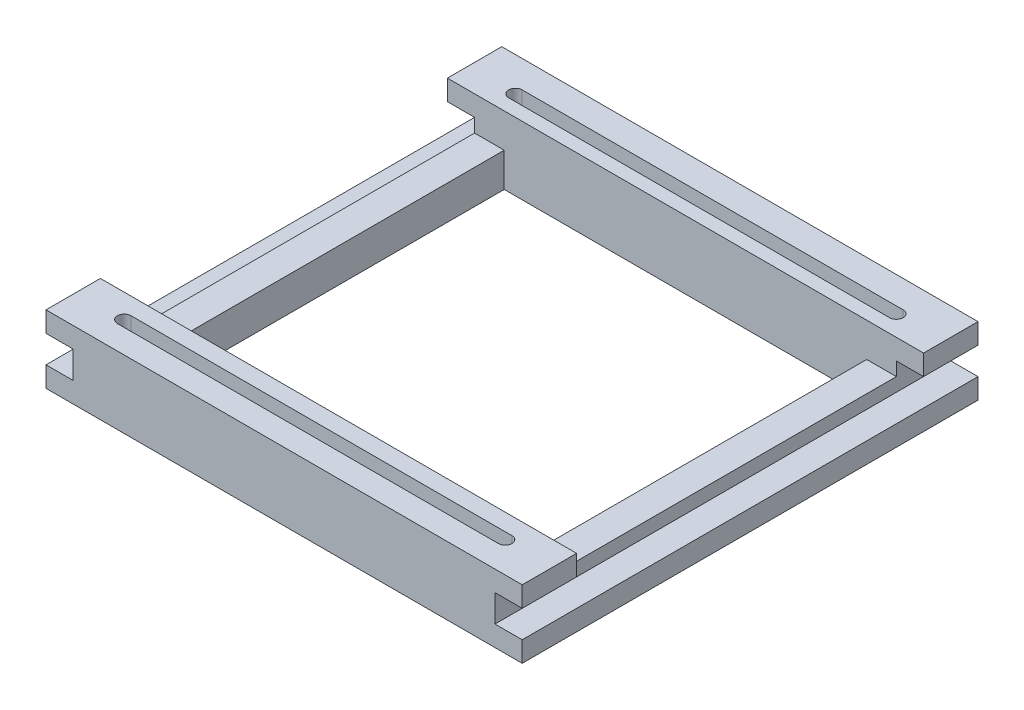
ISO-10303-21;
HEADER;
FILE_DESCRIPTION(('STEP AP214'),'2;1');
FILE_NAME('part.step','',(''),(''),'','','');
FILE_SCHEMA(('AUTOMOTIVE_DESIGN { 1 0 10303 214 1 1 1 1 }'));
ENDSEC;
DATA;
#1=APPLICATION_CONTEXT('core data for automotive mechanical design processes');
#2=APPLICATION_PROTOCOL_DEFINITION('international standard','automotive_design',2000,#1);
#3=PRODUCT_CONTEXT('',#1,'mechanical');
#4=PRODUCT('Part','Part','',(#3));
#5=PRODUCT_RELATED_PRODUCT_CATEGORY('part','',(#4));
#6=PRODUCT_DEFINITION_FORMATION('','',#4);
#7=PRODUCT_DEFINITION_CONTEXT('part definition',#1,'design');
#8=PRODUCT_DEFINITION('design','',#6,#7);
#9=PRODUCT_DEFINITION_SHAPE('','',#8);
#10=(LENGTH_UNIT() NAMED_UNIT(*) SI_UNIT(.MILLI.,.METRE.));
#11=(NAMED_UNIT(*) PLANE_ANGLE_UNIT() SI_UNIT($,.RADIAN.));
#12=(NAMED_UNIT(*) SI_UNIT($,.STERADIAN.) SOLID_ANGLE_UNIT());
#13=UNCERTAINTY_MEASURE_WITH_UNIT(LENGTH_MEASURE(1.E-05),#10,'distance_accuracy_value','');
#14=(GEOMETRIC_REPRESENTATION_CONTEXT(3) GLOBAL_UNCERTAINTY_ASSIGNED_CONTEXT((#13)) GLOBAL_UNIT_ASSIGNED_CONTEXT((#10,
#11,#12)) REPRESENTATION_CONTEXT('',''));
#15=CARTESIAN_POINT('',(0.,0.,0.));
#16=DIRECTION('',(0.,0.,1.));
#17=DIRECTION('',(1.,0.,0.));
#18=AXIS2_PLACEMENT_3D('',#15,#16,#17);
#19=CARTESIAN_POINT('',(35.,10.,33.5));
#20=DIRECTION('',(-1.,0.,0.));
#21=DIRECTION('',(0.,0.,1.));
#22=AXIS2_PLACEMENT_3D('',#19,#20,#21);
#23=PLANE('',#22);
#24=DIRECTION('',(0.,-1.,0.));
#25=VECTOR('',#24,1.);
#26=CARTESIAN_POINT('',(35.,10.,-33.5));
#27=LINE('',#26,#25);
#28=CARTESIAN_POINT('',(35.,3.,-33.5));
#29=VERTEX_POINT('',#28);
#30=CARTESIAN_POINT('',(35.,0.,-33.5));
#31=VERTEX_POINT('',#30);
#32=EDGE_CURVE('E467',#29,#31,#27,.T.);
#33=ORIENTED_EDGE('',*,*,#32,.F.);
#34=DIRECTION('',(0.,0.,1.));
#35=VECTOR('',#34,1.);
#36=CARTESIAN_POINT('',(35.,3.,-33.5));
#37=LINE('',#36,#35);
#38=CARTESIAN_POINT('',(35.,3.,33.5));
#39=VERTEX_POINT('',#38);
#40=EDGE_CURVE('E332',#29,#39,#37,.T.);
#41=ORIENTED_EDGE('',*,*,#40,.T.);
#42=DIRECTION('',(0.,-1.,0.));
#43=VECTOR('',#42,1.);
#44=CARTESIAN_POINT('',(35.,10.,33.5));
#45=LINE('',#44,#43);
#46=CARTESIAN_POINT('',(35.,0.,33.5));
#47=VERTEX_POINT('',#46);
#48=EDGE_CURVE('E444',#39,#47,#45,.T.);
#49=ORIENTED_EDGE('',*,*,#48,.T.);
#50=DIRECTION('',(0.,0.,-1.));
#51=VECTOR('',#50,1.);
#52=CARTESIAN_POINT('',(35.,0.,33.5));
#53=LINE('',#52,#51);
#54=EDGE_CURVE('E431',#47,#31,#53,.T.);
#55=ORIENTED_EDGE('',*,*,#54,.T.);
#56=EDGE_LOOP('',(#33,#41,#49,#55));
#57=FACE_BOUND('',#56,.T.);
#58=ADVANCED_FACE('F38',(#57),#23,.F.);
#59=CARTESIAN_POINT('',(35.,10.,33.5));
#60=VERTEX_POINT('',#59);
#61=CARTESIAN_POINT('',(35.,7.,33.5));
#62=VERTEX_POINT('',#61);
#63=EDGE_CURVE('E456',#60,#62,#45,.T.);
#64=ORIENTED_EDGE('',*,*,#63,.T.);
#65=DIRECTION('',(0.,0.,1.));
#66=VECTOR('',#65,1.);
#67=CARTESIAN_POINT('',(35.,7.,-33.5));
#68=LINE('',#67,#66);
#69=CARTESIAN_POINT('',(35.,7.,25.5));
#70=VERTEX_POINT('',#69);
#71=EDGE_CURVE('E323',#70,#62,#68,.T.);
#72=ORIENTED_EDGE('',*,*,#71,.F.);
#73=DIRECTION('',(0.,1.,0.));
#74=VECTOR('',#73,1.);
#75=CARTESIAN_POINT('',(35.,5.,25.5));
#76=LINE('',#75,#74);
#77=CARTESIAN_POINT('',(35.,10.,25.5));
#78=VERTEX_POINT('',#77);
#79=EDGE_CURVE('E403',#70,#78,#76,.T.);
#80=ORIENTED_EDGE('',*,*,#79,.T.);
#81=DIRECTION('',(0.,0.,-1.));
#82=VECTOR('',#81,1.);
#83=CARTESIAN_POINT('',(35.,10.,33.5));
#84=LINE('',#83,#82);
#85=EDGE_CURVE('E432',#60,#78,#84,.T.);
#86=ORIENTED_EDGE('',*,*,#85,.F.);
#87=EDGE_LOOP('',(#64,#72,#80,#86));
#88=FACE_BOUND('',#87,.T.);
#89=ADVANCED_FACE('F535',(#88),#23,.F.);
#90=CARTESIAN_POINT('',(-35.,10.,33.5));
#91=DIRECTION('',(1.,0.,0.));
#92=DIRECTION('',(0.,0.,-1.));
#93=AXIS2_PLACEMENT_3D('',#90,#91,#92);
#94=PLANE('',#93);
#95=DIRECTION('',(0.,-1.,0.));
#96=VECTOR('',#95,1.);
#97=CARTESIAN_POINT('',(-35.,10.,-33.5));
#98=LINE('',#97,#96);
#99=CARTESIAN_POINT('',(-35.,10.,-33.5));
#100=VERTEX_POINT('',#99);
#101=CARTESIAN_POINT('',(-35.,7.,-33.5));
#102=VERTEX_POINT('',#101);
#103=EDGE_CURVE('E464',#100,#102,#98,.T.);
#104=ORIENTED_EDGE('',*,*,#103,.T.);
#105=DIRECTION('',(0.,0.,1.));
#106=VECTOR('',#105,1.);
#107=CARTESIAN_POINT('',(-35.,7.,-33.5));
#108=LINE('',#107,#106);
#109=CARTESIAN_POINT('',(-35.,7.,-25.5));
#110=VERTEX_POINT('',#109);
#111=EDGE_CURVE('E328',#102,#110,#108,.T.);
#112=ORIENTED_EDGE('',*,*,#111,.T.);
#113=DIRECTION('',(0.,1.,0.));
#114=VECTOR('',#113,1.);
#115=CARTESIAN_POINT('',(-35.,5.,-25.5));
#116=LINE('',#115,#114);
#117=CARTESIAN_POINT('',(-35.,10.,-25.5));
#118=VERTEX_POINT('',#117);
#119=EDGE_CURVE('E392',#110,#118,#116,.T.);
#120=ORIENTED_EDGE('',*,*,#119,.T.);
#121=DIRECTION('',(0.,0.,1.));
#122=VECTOR('',#121,1.);
#123=CARTESIAN_POINT('',(-35.,10.,33.5));
#124=LINE('',#123,#122);
#125=EDGE_CURVE('E439',#100,#118,#124,.T.);
#126=ORIENTED_EDGE('',*,*,#125,.F.);
#127=EDGE_LOOP('',(#104,#112,#120,#126));
#128=FACE_BOUND('',#127,.T.);
#129=ADVANCED_FACE('F577',(#128),#94,.F.);
#130=DIRECTION('',(0.,1.,0.));
#131=VECTOR('',#130,1.);
#132=CARTESIAN_POINT('',(-35.,5.,25.5));
#133=LINE('',#132,#131);
#134=CARTESIAN_POINT('',(-35.,7.,25.5));
#135=VERTEX_POINT('',#134);
#136=CARTESIAN_POINT('',(-35.,10.,25.5));
#137=VERTEX_POINT('',#136);
#138=EDGE_CURVE('E393',#135,#137,#133,.T.);
#139=ORIENTED_EDGE('',*,*,#138,.F.);
#140=CARTESIAN_POINT('',(-35.,7.,33.5));
#141=VERTEX_POINT('',#140);
#142=EDGE_CURVE('E363',#135,#141,#108,.T.);
#143=ORIENTED_EDGE('',*,*,#142,.T.);
#144=DIRECTION('',(0.,-1.,0.));
#145=VECTOR('',#144,1.);
#146=CARTESIAN_POINT('',(-35.,10.,33.5));
#147=LINE('',#146,#145);
#148=CARTESIAN_POINT('',(-35.,10.,33.5));
#149=VERTEX_POINT('',#148);
#150=EDGE_CURVE('E460',#149,#141,#147,.T.);
#151=ORIENTED_EDGE('',*,*,#150,.F.);
#152=EDGE_CURVE('E438',#137,#149,#124,.T.);
#153=ORIENTED_EDGE('',*,*,#152,.F.);
#154=EDGE_LOOP('',(#139,#143,#151,#153));
#155=FACE_BOUND('',#154,.T.);
#156=ADVANCED_FACE('F526',(#155),#94,.F.);
#157=CARTESIAN_POINT('',(0.,10.,0.));
#158=DIRECTION('',(0.,-1.,0.));
#159=DIRECTION('',(0.,0.,-1.));
#160=AXIS2_PLACEMENT_3D('',#157,#158,#159);
#161=PLANE('',#160);
#162=DIRECTION('',(1.,0.,0.));
#163=VECTOR('',#162,1.);
#164=CARTESIAN_POINT('',(-28.,10.,28.));
#165=LINE('',#164,#163);
#166=CARTESIAN_POINT('',(-28.,10.,28.));
#167=VERTEX_POINT('',#166);
#168=CARTESIAN_POINT('',(28.,10.,28.));
#169=VERTEX_POINT('',#168);
#170=EDGE_CURVE('E301',#167,#169,#165,.T.);
#171=ORIENTED_EDGE('',*,*,#170,.T.);
#172=CARTESIAN_POINT('',(28.,10.,29.));
#173=DIRECTION('',(0.,1.,0.));
#174=DIRECTION('',(0.,0.,1.));
#175=AXIS2_PLACEMENT_3D('',#172,#173,#174);
#176=CIRCLE('',#175,0.999999999999997);
#177=CARTESIAN_POINT('',(28.,10.,30.));
#178=VERTEX_POINT('',#177);
#179=EDGE_CURVE('E53',#178,#169,#176,.T.);
#180=ORIENTED_EDGE('',*,*,#179,.F.);
#181=DIRECTION('',(-1.,0.,0.));
#182=VECTOR('',#181,1.);
#183=CARTESIAN_POINT('',(28.,10.,30.));
#184=LINE('',#183,#182);
#185=CARTESIAN_POINT('',(-28.,10.,30.));
#186=VERTEX_POINT('',#185);
#187=EDGE_CURVE('E294',#178,#186,#184,.T.);
#188=ORIENTED_EDGE('',*,*,#187,.T.);
#189=CARTESIAN_POINT('',(-28.,10.,29.));
#190=DIRECTION('',(0.,1.,0.));
#191=DIRECTION('',(0.,0.,1.));
#192=AXIS2_PLACEMENT_3D('',#189,#190,#191);
#193=CIRCLE('',#192,0.999999999999997);
#194=EDGE_CURVE('E297',#167,#186,#193,.T.);
#195=ORIENTED_EDGE('',*,*,#194,.F.);
#196=EDGE_LOOP('',(#171,#180,#188,#195));
#197=FACE_BOUND('',#196,.T.);
#198=DIRECTION('',(1.,0.,0.));
#199=VECTOR('',#198,1.);
#200=CARTESIAN_POINT('',(-26.6417910447761,10.,25.5));
#201=LINE('',#200,#199);
#202=EDGE_CURVE('E409',#137,#78,#201,.T.);
#203=ORIENTED_EDGE('',*,*,#202,.F.);
#204=ORIENTED_EDGE('',*,*,#152,.T.);
#205=DIRECTION('',(1.,0.,0.));
#206=VECTOR('',#205,1.);
#207=CARTESIAN_POINT('',(-35.,10.,33.5));
#208=LINE('',#207,#206);
#209=EDGE_CURVE('E442',#149,#60,#208,.T.);
#210=ORIENTED_EDGE('',*,*,#209,.T.);
#211=ORIENTED_EDGE('',*,*,#85,.T.);
#212=EDGE_LOOP('',(#203,#204,#210,#211));
#213=FACE_BOUND('',#212,.T.);
#214=ADVANCED_FACE('F531',(#197,#213),#161,.F.);
#215=CARTESIAN_POINT('',(26.6417910447761,10.,25.5));
#216=DIRECTION('',(-1.,0.,0.));
#217=DIRECTION('',(0.,0.,1.));
#218=AXIS2_PLACEMENT_3D('',#215,#216,#217);
#219=PLANE('',#218);
#220=DIRECTION('',(0.,-1.,0.));
#221=VECTOR('',#220,1.);
#222=CARTESIAN_POINT('',(26.6417910447761,10.,25.5));
#223=LINE('',#222,#221);
#224=CARTESIAN_POINT('',(26.6417910447761,5.,25.5));
#225=VERTEX_POINT('',#224);
#226=CARTESIAN_POINT('',(26.6417910447761,0.,25.5));
#227=VERTEX_POINT('',#226);
#228=EDGE_CURVE('E413',#225,#227,#223,.T.);
#229=ORIENTED_EDGE('',*,*,#228,.F.);
#230=DIRECTION('',(0.,0.,1.));
#231=VECTOR('',#230,1.);
#232=CARTESIAN_POINT('',(26.6417910447761,5.,-25.5));
#233=LINE('',#232,#231);
#234=CARTESIAN_POINT('',(26.6417910447761,5.,-25.5));
#235=VERTEX_POINT('',#234);
#236=EDGE_CURVE('E382',#235,#225,#233,.T.);
#237=ORIENTED_EDGE('',*,*,#236,.F.);
#238=DIRECTION('',(0.,-1.,0.));
#239=VECTOR('',#238,1.);
#240=CARTESIAN_POINT('',(26.6417910447761,10.,-25.5));
#241=LINE('',#240,#239);
#242=CARTESIAN_POINT('',(26.6417910447761,0.,-25.5));
#243=VERTEX_POINT('',#242);
#244=EDGE_CURVE('E429',#235,#243,#241,.T.);
#245=ORIENTED_EDGE('',*,*,#244,.T.);
#246=DIRECTION('',(0.,0.,-1.));
#247=VECTOR('',#246,1.);
#248=CARTESIAN_POINT('',(26.6417910447761,0.,25.5));
#249=LINE('',#248,#247);
#250=EDGE_CURVE('E395',#227,#243,#249,.T.);
#251=ORIENTED_EDGE('',*,*,#250,.F.);
#252=EDGE_LOOP('',(#229,#237,#245,#251));
#253=FACE_BOUND('',#252,.T.);
#254=ADVANCED_FACE('F556',(#253),#219,.T.);
#255=DIRECTION('',(-1.,0.,0.));
#256=VECTOR('',#255,1.);
#257=CARTESIAN_POINT('',(28.,10.,-27.5));
#258=LINE('',#257,#256);
#259=CARTESIAN_POINT('',(28.,10.,-27.5));
#260=VERTEX_POINT('',#259);
#261=CARTESIAN_POINT('',(-28.,10.,-27.5));
#262=VERTEX_POINT('',#261);
#263=EDGE_CURVE('E275',#260,#262,#258,.T.);
#264=ORIENTED_EDGE('',*,*,#263,.T.);
#265=CARTESIAN_POINT('',(-28.,10.,-28.5));
#266=DIRECTION('',(0.,1.,0.));
#267=DIRECTION('',(0.,0.,1.));
#268=AXIS2_PLACEMENT_3D('',#265,#266,#267);
#269=CIRCLE('',#268,1.);
#270=CARTESIAN_POINT('',(-28.,10.,-29.5));
#271=VERTEX_POINT('',#270);
#272=EDGE_CURVE('E61',#271,#262,#269,.T.);
#273=ORIENTED_EDGE('',*,*,#272,.F.);
#274=DIRECTION('',(1.,0.,0.));
#275=VECTOR('',#274,1.);
#276=CARTESIAN_POINT('',(-28.,10.,-29.5));
#277=LINE('',#276,#275);
#278=CARTESIAN_POINT('',(28.,10.,-29.5));
#279=VERTEX_POINT('',#278);
#280=EDGE_CURVE('E266',#271,#279,#277,.T.);
#281=ORIENTED_EDGE('',*,*,#280,.T.);
#282=CARTESIAN_POINT('',(28.,10.,-28.5));
#283=DIRECTION('',(0.,1.,0.));
#284=DIRECTION('',(0.,0.,1.));
#285=AXIS2_PLACEMENT_3D('',#282,#283,#284);
#286=CIRCLE('',#285,1.);
#287=EDGE_CURVE('E269',#260,#279,#286,.T.);
#288=ORIENTED_EDGE('',*,*,#287,.F.);
#289=EDGE_LOOP('',(#264,#273,#281,#288));
#290=FACE_BOUND('',#289,.T.);
#291=ORIENTED_EDGE('',*,*,#125,.T.);
#292=DIRECTION('',(-1.,0.,0.));
#293=VECTOR('',#292,1.);
#294=CARTESIAN_POINT('',(26.6417910447761,10.,-25.5));
#295=LINE('',#294,#293);
#296=CARTESIAN_POINT('',(35.,10.,-25.5));
#297=VERTEX_POINT('',#296);
#298=EDGE_CURVE('E406',#297,#118,#295,.T.);
#299=ORIENTED_EDGE('',*,*,#298,.F.);
#300=CARTESIAN_POINT('',(35.,10.,-33.5));
#301=VERTEX_POINT('',#300);
#302=EDGE_CURVE('E436',#297,#301,#84,.T.);
#303=ORIENTED_EDGE('',*,*,#302,.T.);
#304=DIRECTION('',(-1.,0.,0.));
#305=VECTOR('',#304,1.);
#306=CARTESIAN_POINT('',(-35.,10.,-33.5));
#307=LINE('',#306,#305);
#308=EDGE_CURVE('E435',#301,#100,#307,.T.);
#309=ORIENTED_EDGE('',*,*,#308,.T.);
#310=EDGE_LOOP('',(#291,#299,#303,#309));
#311=FACE_BOUND('',#310,.T.);
#312=ADVANCED_FACE('F560',(#290,#311),#161,.F.);
#313=CARTESIAN_POINT('',(0.,0.,0.));
#314=DIRECTION('',(0.,-1.,0.));
#315=DIRECTION('',(0.,0.,-1.));
#316=AXIS2_PLACEMENT_3D('',#313,#314,#315);
#317=PLANE('',#316);
#318=ORIENTED_EDGE('',*,*,#54,.F.);
#319=DIRECTION('',(1.,0.,0.));
#320=VECTOR('',#319,1.);
#321=CARTESIAN_POINT('',(-35.,0.,33.5));
#322=LINE('',#321,#320);
#323=CARTESIAN_POINT('',(-35.,0.,33.5));
#324=VERTEX_POINT('',#323);
#325=EDGE_CURVE('E453',#324,#47,#322,.T.);
#326=ORIENTED_EDGE('',*,*,#325,.F.);
#327=DIRECTION('',(0.,0.,1.));
#328=VECTOR('',#327,1.);
#329=CARTESIAN_POINT('',(-35.,0.,33.5));
#330=LINE('',#329,#328);
#331=CARTESIAN_POINT('',(-35.,0.,-33.5));
#332=VERTEX_POINT('',#331);
#333=EDGE_CURVE('E450',#332,#324,#330,.T.);
#334=ORIENTED_EDGE('',*,*,#333,.F.);
#335=DIRECTION('',(-1.,0.,0.));
#336=VECTOR('',#335,1.);
#337=CARTESIAN_POINT('',(-35.,0.,-33.5));
#338=LINE('',#337,#336);
#339=EDGE_CURVE('E447',#31,#332,#338,.T.);
#340=ORIENTED_EDGE('',*,*,#339,.F.);
#341=EDGE_LOOP('',(#318,#326,#334,#340));
#342=FACE_BOUND('',#341,.T.);
#343=DIRECTION('',(1.,0.,0.));
#344=VECTOR('',#343,1.);
#345=CARTESIAN_POINT('',(-26.6417910447761,0.,25.5));
#346=LINE('',#345,#344);
#347=CARTESIAN_POINT('',(-26.6417910447761,0.,25.5));
#348=VERTEX_POINT('',#347);
#349=EDGE_CURVE('E410',#348,#227,#346,.T.);
#350=ORIENTED_EDGE('',*,*,#349,.T.);
#351=ORIENTED_EDGE('',*,*,#250,.T.);
#352=DIRECTION('',(-1.,0.,0.));
#353=VECTOR('',#352,1.);
#354=CARTESIAN_POINT('',(26.6417910447761,0.,-25.5));
#355=LINE('',#354,#353);
#356=CARTESIAN_POINT('',(-26.6417910447761,0.,-25.5));
#357=VERTEX_POINT('',#356);
#358=EDGE_CURVE('E416',#243,#357,#355,.T.);
#359=ORIENTED_EDGE('',*,*,#358,.T.);
#360=DIRECTION('',(0.,0.,1.));
#361=VECTOR('',#360,1.);
#362=CARTESIAN_POINT('',(-26.6417910447761,0.,-25.5));
#363=LINE('',#362,#361);
#364=EDGE_CURVE('E419',#357,#348,#363,.T.);
#365=ORIENTED_EDGE('',*,*,#364,.T.);
#366=EDGE_LOOP('',(#350,#351,#359,#365));
#367=FACE_BOUND('',#366,.T.);
#368=ADVANCED_FACE('F558',(#342,#367),#317,.T.);
#369=DIRECTION('',(0.,1.,0.));
#370=VECTOR('',#369,1.);
#371=CARTESIAN_POINT('',(35.,5.,-25.5));
#372=LINE('',#371,#370);
#373=CARTESIAN_POINT('',(35.,7.,-25.5));
#374=VERTEX_POINT('',#373);
#375=EDGE_CURVE('E387',#374,#297,#372,.T.);
#376=ORIENTED_EDGE('',*,*,#375,.F.);
#377=CARTESIAN_POINT('',(35.,7.,-33.5));
#378=VERTEX_POINT('',#377);
#379=EDGE_CURVE('E342',#378,#374,#68,.T.);
#380=ORIENTED_EDGE('',*,*,#379,.F.);
#381=EDGE_CURVE('E468',#301,#378,#27,.T.);
#382=ORIENTED_EDGE('',*,*,#381,.F.);
#383=ORIENTED_EDGE('',*,*,#302,.F.);
#384=EDGE_LOOP('',(#376,#380,#382,#383));
#385=FACE_BOUND('',#384,.T.);
#386=ADVANCED_FACE('F40',(#385),#23,.F.);
#387=CARTESIAN_POINT('',(-35.,10.,-33.5));
#388=DIRECTION('',(0.,0.,1.));
#389=DIRECTION('',(1.,0.,0.));
#390=AXIS2_PLACEMENT_3D('',#387,#388,#389);
#391=PLANE('',#390);
#392=DIRECTION('',(0.,-1.,0.));
#393=VECTOR('',#392,1.);
#394=CARTESIAN_POINT('',(31.,3.,-33.5));
#395=LINE('',#394,#393);
#396=CARTESIAN_POINT('',(31.,7.,-33.5));
#397=VERTEX_POINT('',#396);
#398=CARTESIAN_POINT('',(31.,3.,-33.5));
#399=VERTEX_POINT('',#398);
#400=EDGE_CURVE('E316',#397,#399,#395,.T.);
#401=ORIENTED_EDGE('',*,*,#400,.T.);
#402=DIRECTION('',(1.,0.,0.));
#403=VECTOR('',#402,1.);
#404=CARTESIAN_POINT('',(35.,3.,-33.5));
#405=LINE('',#404,#403);
#406=EDGE_CURVE('E320',#399,#29,#405,.T.);
#407=ORIENTED_EDGE('',*,*,#406,.T.);
#408=ORIENTED_EDGE('',*,*,#32,.T.);
#409=ORIENTED_EDGE('',*,*,#339,.T.);
#410=CARTESIAN_POINT('',(-35.,3.,-33.5));
#411=VERTEX_POINT('',#410);
#412=EDGE_CURVE('E463',#411,#332,#98,.T.);
#413=ORIENTED_EDGE('',*,*,#412,.F.);
#414=DIRECTION('',(1.,0.,0.));
#415=VECTOR('',#414,1.);
#416=CARTESIAN_POINT('',(-35.,3.,-33.5));
#417=LINE('',#416,#415);
#418=CARTESIAN_POINT('',(-31.,3.,-33.5));
#419=VERTEX_POINT('',#418);
#420=EDGE_CURVE('E344',#411,#419,#417,.T.);
#421=ORIENTED_EDGE('',*,*,#420,.T.);
#422=DIRECTION('',(0.,1.,0.));
#423=VECTOR('',#422,1.);
#424=CARTESIAN_POINT('',(-31.,7.,-33.5));
#425=LINE('',#424,#423);
#426=CARTESIAN_POINT('',(-31.,7.,-33.5));
#427=VERTEX_POINT('',#426);
#428=EDGE_CURVE('E347',#419,#427,#425,.T.);
#429=ORIENTED_EDGE('',*,*,#428,.T.);
#430=DIRECTION('',(-1.,0.,0.));
#431=VECTOR('',#430,1.);
#432=CARTESIAN_POINT('',(-35.,7.,-33.5));
#433=LINE('',#432,#431);
#434=EDGE_CURVE('E351',#427,#102,#433,.T.);
#435=ORIENTED_EDGE('',*,*,#434,.T.);
#436=ORIENTED_EDGE('',*,*,#103,.F.);
#437=ORIENTED_EDGE('',*,*,#308,.F.);
#438=ORIENTED_EDGE('',*,*,#381,.T.);
#439=DIRECTION('',(-1.,0.,0.));
#440=VECTOR('',#439,1.);
#441=CARTESIAN_POINT('',(35.,7.,-33.5));
#442=LINE('',#441,#440);
#443=EDGE_CURVE('E313',#378,#397,#442,.T.);
#444=ORIENTED_EDGE('',*,*,#443,.T.);
#445=EDGE_LOOP('',(#401,#407,#408,#409,#413,#421,#429,#435,#436,#437,#438,#444));
#446=FACE_BOUND('',#445,.T.);
#447=ADVANCED_FACE('F513',(#446),#391,.F.);
#448=CARTESIAN_POINT('',(-35.,3.,33.5));
#449=VERTEX_POINT('',#448);
#450=EDGE_CURVE('E459',#449,#324,#147,.T.);
#451=ORIENTED_EDGE('',*,*,#450,.F.);
#452=DIRECTION('',(0.,0.,1.));
#453=VECTOR('',#452,1.);
#454=CARTESIAN_POINT('',(-35.,3.,-33.5));
#455=LINE('',#454,#453);
#456=EDGE_CURVE('E354',#411,#449,#455,.T.);
#457=ORIENTED_EDGE('',*,*,#456,.F.);
#458=ORIENTED_EDGE('',*,*,#412,.T.);
#459=ORIENTED_EDGE('',*,*,#333,.T.);
#460=EDGE_LOOP('',(#451,#457,#458,#459));
#461=FACE_BOUND('',#460,.T.);
#462=ADVANCED_FACE('F584',(#461),#94,.F.);
#463=CARTESIAN_POINT('',(-35.,10.,33.5));
#464=DIRECTION('',(0.,0.,-1.));
#465=DIRECTION('',(-1.,0.,0.));
#466=AXIS2_PLACEMENT_3D('',#463,#464,#465);
#467=PLANE('',#466);
#468=ORIENTED_EDGE('',*,*,#48,.F.);
#469=DIRECTION('',(1.,0.,0.));
#470=VECTOR('',#469,1.);
#471=CARTESIAN_POINT('',(35.,3.,33.5));
#472=LINE('',#471,#470);
#473=CARTESIAN_POINT('',(31.,3.,33.5));
#474=VERTEX_POINT('',#473);
#475=EDGE_CURVE('E317',#474,#39,#472,.T.);
#476=ORIENTED_EDGE('',*,*,#475,.F.);
#477=DIRECTION('',(0.,-1.,0.));
#478=VECTOR('',#477,1.);
#479=CARTESIAN_POINT('',(31.,3.,33.5));
#480=LINE('',#479,#478);
#481=CARTESIAN_POINT('',(31.,7.,33.5));
#482=VERTEX_POINT('',#481);
#483=EDGE_CURVE('E327',#482,#474,#480,.T.);
#484=ORIENTED_EDGE('',*,*,#483,.F.);
#485=DIRECTION('',(-1.,0.,0.));
#486=VECTOR('',#485,1.);
#487=CARTESIAN_POINT('',(35.,7.,33.5));
#488=LINE('',#487,#486);
#489=EDGE_CURVE('E324',#62,#482,#488,.T.);
#490=ORIENTED_EDGE('',*,*,#489,.F.);
#491=ORIENTED_EDGE('',*,*,#63,.F.);
#492=ORIENTED_EDGE('',*,*,#209,.F.);
#493=ORIENTED_EDGE('',*,*,#150,.T.);
#494=DIRECTION('',(-1.,0.,0.));
#495=VECTOR('',#494,1.);
#496=CARTESIAN_POINT('',(-35.,7.,33.5));
#497=LINE('',#496,#495);
#498=CARTESIAN_POINT('',(-31.,7.,33.5));
#499=VERTEX_POINT('',#498);
#500=EDGE_CURVE('E348',#499,#141,#497,.T.);
#501=ORIENTED_EDGE('',*,*,#500,.F.);
#502=DIRECTION('',(0.,1.,0.));
#503=VECTOR('',#502,1.);
#504=CARTESIAN_POINT('',(-31.,7.,33.5));
#505=LINE('',#504,#503);
#506=CARTESIAN_POINT('',(-31.,3.,33.5));
#507=VERTEX_POINT('',#506);
#508=EDGE_CURVE('E357',#507,#499,#505,.T.);
#509=ORIENTED_EDGE('',*,*,#508,.F.);
#510=DIRECTION('',(1.,0.,0.));
#511=VECTOR('',#510,1.);
#512=CARTESIAN_POINT('',(-35.,3.,33.5));
#513=LINE('',#512,#511);
#514=EDGE_CURVE('E281',#449,#507,#513,.T.);
#515=ORIENTED_EDGE('',*,*,#514,.F.);
#516=ORIENTED_EDGE('',*,*,#450,.T.);
#517=ORIENTED_EDGE('',*,*,#325,.T.);
#518=EDGE_LOOP('',(#468,#476,#484,#490,#491,#492,#493,#501,#509,#515,#516,#517));
#519=FACE_BOUND('',#518,.T.);
#520=ADVANCED_FACE('F522',(#519),#467,.F.);
#521=CARTESIAN_POINT('',(26.6417910447761,10.,-25.5));
#522=DIRECTION('',(0.,0.,1.));
#523=DIRECTION('',(1.,0.,0.));
#524=AXIS2_PLACEMENT_3D('',#521,#522,#523);
#525=PLANE('',#524);
#526=DIRECTION('',(0.,-1.,0.));
#527=VECTOR('',#526,1.);
#528=CARTESIAN_POINT('',(31.,10.,-25.5));
#529=LINE('',#528,#527);
#530=CARTESIAN_POINT('',(31.,7.,-25.5));
#531=VERTEX_POINT('',#530);
#532=CARTESIAN_POINT('',(31.,5.,-25.5));
#533=VERTEX_POINT('',#532);
#534=EDGE_CURVE('E376',#531,#533,#529,.T.);
#535=ORIENTED_EDGE('',*,*,#534,.F.);
#536=DIRECTION('',(-1.,0.,0.));
#537=VECTOR('',#536,1.);
#538=CARTESIAN_POINT('',(26.6417910447761,7.,-25.5));
#539=LINE('',#538,#537);
#540=EDGE_CURVE('E380',#374,#531,#539,.T.);
#541=ORIENTED_EDGE('',*,*,#540,.F.);
#542=ORIENTED_EDGE('',*,*,#375,.T.);
#543=ORIENTED_EDGE('',*,*,#298,.T.);
#544=ORIENTED_EDGE('',*,*,#119,.F.);
#545=DIRECTION('',(-1.,0.,0.));
#546=VECTOR('',#545,1.);
#547=CARTESIAN_POINT('',(26.6417910447761,7.00000000000003,-25.5));
#548=LINE('',#547,#546);
#549=CARTESIAN_POINT('',(-31.,7.,-25.5));
#550=VERTEX_POINT('',#549);
#551=EDGE_CURVE('E378',#550,#110,#548,.T.);
#552=ORIENTED_EDGE('',*,*,#551,.F.);
#553=DIRECTION('',(0.,1.,0.));
#554=VECTOR('',#553,1.);
#555=CARTESIAN_POINT('',(-31.,10.,-25.5));
#556=LINE('',#555,#554);
#557=CARTESIAN_POINT('',(-31.,5.,-25.5));
#558=VERTEX_POINT('',#557);
#559=EDGE_CURVE('E372',#558,#550,#556,.T.);
#560=ORIENTED_EDGE('',*,*,#559,.F.);
#561=DIRECTION('',(-1.,0.,0.));
#562=VECTOR('',#561,1.);
#563=CARTESIAN_POINT('',(-26.6417910447761,5.,-25.5));
#564=LINE('',#563,#562);
#565=CARTESIAN_POINT('',(-26.6417910447761,5.,-25.5));
#566=VERTEX_POINT('',#565);
#567=EDGE_CURVE('E386',#566,#558,#564,.T.);
#568=ORIENTED_EDGE('',*,*,#567,.F.);
#569=DIRECTION('',(0.,-1.,0.));
#570=VECTOR('',#569,1.);
#571=CARTESIAN_POINT('',(-26.6417910447761,10.,-25.5));
#572=LINE('',#571,#570);
#573=EDGE_CURVE('E427',#566,#357,#572,.T.);
#574=ORIENTED_EDGE('',*,*,#573,.T.);
#575=ORIENTED_EDGE('',*,*,#358,.F.);
#576=ORIENTED_EDGE('',*,*,#244,.F.);
#577=DIRECTION('',(-1.,0.,0.));
#578=VECTOR('',#577,1.);
#579=CARTESIAN_POINT('',(26.6417910447761,5.,-25.5));
#580=LINE('',#579,#578);
#581=EDGE_CURVE('E401',#533,#235,#580,.T.);
#582=ORIENTED_EDGE('',*,*,#581,.F.);
#583=EDGE_LOOP('',(#535,#541,#542,#543,#544,#552,#560,#568,#574,#575,#576,#582));
#584=FACE_BOUND('',#583,.T.);
#585=ADVANCED_FACE('F502',(#584),#525,.T.);
#586=CARTESIAN_POINT('',(-26.6417910447761,10.,-25.5));
#587=DIRECTION('',(1.,0.,0.));
#588=DIRECTION('',(0.,0.,-1.));
#589=AXIS2_PLACEMENT_3D('',#586,#587,#588);
#590=PLANE('',#589);
#591=DIRECTION('',(0.,0.,-1.));
#592=VECTOR('',#591,1.);
#593=CARTESIAN_POINT('',(-26.6417910447761,5.,-25.5));
#594=LINE('',#593,#592);
#595=CARTESIAN_POINT('',(-26.6417910447761,5.,25.5));
#596=VERTEX_POINT('',#595);
#597=EDGE_CURVE('E383',#596,#566,#594,.T.);
#598=ORIENTED_EDGE('',*,*,#597,.F.);
#599=DIRECTION('',(0.,-1.,0.));
#600=VECTOR('',#599,1.);
#601=CARTESIAN_POINT('',(-26.6417910447761,10.,25.5));
#602=LINE('',#601,#600);
#603=EDGE_CURVE('E425',#596,#348,#602,.T.);
#604=ORIENTED_EDGE('',*,*,#603,.T.);
#605=ORIENTED_EDGE('',*,*,#364,.F.);
#606=ORIENTED_EDGE('',*,*,#573,.F.);
#607=EDGE_LOOP('',(#598,#604,#605,#606));
#608=FACE_BOUND('',#607,.T.);
#609=ADVANCED_FACE('F497',(#608),#590,.T.);
#610=CARTESIAN_POINT('',(-26.6417910447761,10.,25.5));
#611=DIRECTION('',(0.,0.,-1.));
#612=DIRECTION('',(-1.,0.,0.));
#613=AXIS2_PLACEMENT_3D('',#610,#611,#612);
#614=PLANE('',#613);
#615=DIRECTION('',(0.,1.,0.));
#616=VECTOR('',#615,1.);
#617=CARTESIAN_POINT('',(31.,10.,25.5));
#618=LINE('',#617,#616);
#619=CARTESIAN_POINT('',(31.,5.,25.5));
#620=VERTEX_POINT('',#619);
#621=CARTESIAN_POINT('',(31.,7.,25.5));
#622=VERTEX_POINT('',#621);
#623=EDGE_CURVE('E374',#620,#622,#618,.T.);
#624=ORIENTED_EDGE('',*,*,#623,.F.);
#625=DIRECTION('',(1.,0.,0.));
#626=VECTOR('',#625,1.);
#627=CARTESIAN_POINT('',(26.6417910447761,5.,25.5));
#628=LINE('',#627,#626);
#629=EDGE_CURVE('E398',#225,#620,#628,.T.);
#630=ORIENTED_EDGE('',*,*,#629,.F.);
#631=ORIENTED_EDGE('',*,*,#228,.T.);
#632=ORIENTED_EDGE('',*,*,#349,.F.);
#633=ORIENTED_EDGE('',*,*,#603,.F.);
#634=DIRECTION('',(1.,0.,0.));
#635=VECTOR('',#634,1.);
#636=CARTESIAN_POINT('',(-26.6417910447761,5.,25.5));
#637=LINE('',#636,#635);
#638=CARTESIAN_POINT('',(-31.,5.,25.5));
#639=VERTEX_POINT('',#638);
#640=EDGE_CURVE('E390',#639,#596,#637,.T.);
#641=ORIENTED_EDGE('',*,*,#640,.F.);
#642=DIRECTION('',(0.,-1.,0.));
#643=VECTOR('',#642,1.);
#644=CARTESIAN_POINT('',(-31.,10.,25.5));
#645=LINE('',#644,#643);
#646=CARTESIAN_POINT('',(-31.,7.,25.5));
#647=VERTEX_POINT('',#646);
#648=EDGE_CURVE('E335',#647,#639,#645,.T.);
#649=ORIENTED_EDGE('',*,*,#648,.F.);
#650=DIRECTION('',(1.,0.,0.));
#651=VECTOR('',#650,1.);
#652=CARTESIAN_POINT('',(-26.6417910447761,7.,25.5));
#653=LINE('',#652,#651);
#654=EDGE_CURVE('E46',#135,#647,#653,.T.);
#655=ORIENTED_EDGE('',*,*,#654,.F.);
#656=ORIENTED_EDGE('',*,*,#138,.T.);
#657=ORIENTED_EDGE('',*,*,#202,.T.);
#658=ORIENTED_EDGE('',*,*,#79,.F.);
#659=DIRECTION('',(1.,0.,0.));
#660=VECTOR('',#659,1.);
#661=CARTESIAN_POINT('',(-26.6417910447761,6.99999999999999,25.5));
#662=LINE('',#661,#660);
#663=EDGE_CURVE('E11',#622,#70,#662,.T.);
#664=ORIENTED_EDGE('',*,*,#663,.F.);
#665=EDGE_LOOP('',(#624,#630,#631,#632,#633,#641,#649,#655,#656,#657,#658,#664));
#666=FACE_BOUND('',#665,.T.);
#667=ADVANCED_FACE('F489',(#666),#614,.T.);
#668=CARTESIAN_POINT('',(0.,5.,0.));
#669=DIRECTION('',(0.,1.,0.));
#670=DIRECTION('',(0.,0.,1.));
#671=AXIS2_PLACEMENT_3D('',#668,#669,#670);
#672=PLANE('',#671);
#673=DIRECTION('',(0.,0.,1.));
#674=VECTOR('',#673,1.);
#675=CARTESIAN_POINT('',(31.,5.,0.));
#676=LINE('',#675,#674);
#677=EDGE_CURVE('E474',#533,#620,#676,.T.);
#678=ORIENTED_EDGE('',*,*,#677,.F.);
#679=ORIENTED_EDGE('',*,*,#581,.T.);
#680=ORIENTED_EDGE('',*,*,#236,.T.);
#681=ORIENTED_EDGE('',*,*,#629,.T.);
#682=EDGE_LOOP('',(#678,#679,#680,#681));
#683=FACE_BOUND('',#682,.T.);
#684=ADVANCED_FACE('F550',(#683),#672,.T.);
#685=CARTESIAN_POINT('',(0.,5.,0.));
#686=DIRECTION('',(0.,-1.,0.));
#687=DIRECTION('',(0.,0.,-1.));
#688=AXIS2_PLACEMENT_3D('',#685,#686,#687);
#689=PLANE('',#688);
#690=ORIENTED_EDGE('',*,*,#567,.T.);
#691=DIRECTION('',(0.,0.,1.));
#692=VECTOR('',#691,1.);
#693=CARTESIAN_POINT('',(-31.,5.,0.));
#694=LINE('',#693,#692);
#695=EDGE_CURVE('E471',#558,#639,#694,.T.);
#696=ORIENTED_EDGE('',*,*,#695,.T.);
#697=ORIENTED_EDGE('',*,*,#640,.T.);
#698=ORIENTED_EDGE('',*,*,#597,.T.);
#699=EDGE_LOOP('',(#690,#696,#697,#698));
#700=FACE_BOUND('',#699,.T.);
#701=ADVANCED_FACE('F494',(#700),#689,.F.);
#702=CARTESIAN_POINT('',(-35.,7.,-33.5));
#703=DIRECTION('',(0.,1.,0.));
#704=DIRECTION('',(-1.,0.,0.));
#705=AXIS2_PLACEMENT_3D('',#702,#703,#704);
#706=PLANE('',#705);
#707=ORIENTED_EDGE('',*,*,#551,.T.);
#708=ORIENTED_EDGE('',*,*,#111,.F.);
#709=ORIENTED_EDGE('',*,*,#434,.F.);
#710=DIRECTION('',(0.,0.,1.));
#711=VECTOR('',#710,1.);
#712=CARTESIAN_POINT('',(-31.,7.,-33.5));
#713=LINE('',#712,#711);
#714=EDGE_CURVE('E364',#427,#550,#713,.T.);
#715=ORIENTED_EDGE('',*,*,#714,.T.);
#716=EDGE_LOOP('',(#707,#708,#709,#715));
#717=FACE_BOUND('',#716,.T.);
#718=ADVANCED_FACE('F510',(#717),#706,.F.);
#719=ORIENTED_EDGE('',*,*,#654,.T.);
#720=EDGE_CURVE('E367',#647,#499,#713,.T.);
#721=ORIENTED_EDGE('',*,*,#720,.T.);
#722=ORIENTED_EDGE('',*,*,#500,.T.);
#723=ORIENTED_EDGE('',*,*,#142,.F.);
#724=EDGE_LOOP('',(#719,#721,#722,#723));
#725=FACE_BOUND('',#724,.T.);
#726=ADVANCED_FACE('F478',(#725),#706,.F.);
#727=CARTESIAN_POINT('',(-31.,7.,-33.5));
#728=DIRECTION('',(1.,0.,0.));
#729=DIRECTION('',(0.,0.,-1.));
#730=AXIS2_PLACEMENT_3D('',#727,#728,#729);
#731=PLANE('',#730);
#732=ORIENTED_EDGE('',*,*,#559,.T.);
#733=ORIENTED_EDGE('',*,*,#714,.F.);
#734=ORIENTED_EDGE('',*,*,#428,.F.);
#735=DIRECTION('',(0.,0.,1.));
#736=VECTOR('',#735,1.);
#737=CARTESIAN_POINT('',(-31.,3.,-33.5));
#738=LINE('',#737,#736);
#739=EDGE_CURVE('E368',#419,#507,#738,.T.);
#740=ORIENTED_EDGE('',*,*,#739,.T.);
#741=ORIENTED_EDGE('',*,*,#508,.T.);
#742=ORIENTED_EDGE('',*,*,#720,.F.);
#743=ORIENTED_EDGE('',*,*,#648,.T.);
#744=ORIENTED_EDGE('',*,*,#695,.F.);
#745=EDGE_LOOP('',(#732,#733,#734,#740,#741,#742,#743,#744));
#746=FACE_BOUND('',#745,.T.);
#747=ADVANCED_FACE('F484',(#746),#731,.F.);
#748=CARTESIAN_POINT('',(-35.,3.,-33.5));
#749=DIRECTION('',(0.,-1.,0.));
#750=DIRECTION('',(1.,0.,0.));
#751=AXIS2_PLACEMENT_3D('',#748,#749,#750);
#752=PLANE('',#751);
#753=ORIENTED_EDGE('',*,*,#514,.T.);
#754=ORIENTED_EDGE('',*,*,#739,.F.);
#755=ORIENTED_EDGE('',*,*,#420,.F.);
#756=ORIENTED_EDGE('',*,*,#456,.T.);
#757=EDGE_LOOP('',(#753,#754,#755,#756));
#758=FACE_BOUND('',#757,.T.);
#759=ADVANCED_FACE('F517',(#758),#752,.F.);
#760=CARTESIAN_POINT('',(35.,7.,-33.5));
#761=DIRECTION('',(0.,1.,0.));
#762=DIRECTION('',(-1.,0.,0.));
#763=AXIS2_PLACEMENT_3D('',#760,#761,#762);
#764=PLANE('',#763);
#765=ORIENTED_EDGE('',*,*,#540,.T.);
#766=DIRECTION('',(0.,0.,1.));
#767=VECTOR('',#766,1.);
#768=CARTESIAN_POINT('',(31.,7.,-33.5));
#769=LINE('',#768,#767);
#770=EDGE_CURVE('E338',#397,#531,#769,.T.);
#771=ORIENTED_EDGE('',*,*,#770,.F.);
#772=ORIENTED_EDGE('',*,*,#443,.F.);
#773=ORIENTED_EDGE('',*,*,#379,.T.);
#774=EDGE_LOOP('',(#765,#771,#772,#773));
#775=FACE_BOUND('',#774,.T.);
#776=ADVANCED_FACE('F592',(#775),#764,.F.);
#777=CARTESIAN_POINT('',(35.,3.,-33.5));
#778=DIRECTION('',(0.,-1.,0.));
#779=DIRECTION('',(1.,0.,0.));
#780=AXIS2_PLACEMENT_3D('',#777,#778,#779);
#781=PLANE('',#780);
#782=ORIENTED_EDGE('',*,*,#475,.T.);
#783=ORIENTED_EDGE('',*,*,#40,.F.);
#784=ORIENTED_EDGE('',*,*,#406,.F.);
#785=DIRECTION('',(0.,0.,1.));
#786=VECTOR('',#785,1.);
#787=CARTESIAN_POINT('',(31.,3.,-33.5));
#788=LINE('',#787,#786);
#789=EDGE_CURVE('E336',#399,#474,#788,.T.);
#790=ORIENTED_EDGE('',*,*,#789,.T.);
#791=EDGE_LOOP('',(#782,#783,#784,#790));
#792=FACE_BOUND('',#791,.T.);
#793=ADVANCED_FACE('F586',(#792),#781,.F.);
#794=CARTESIAN_POINT('',(31.,3.,-33.5));
#795=DIRECTION('',(-1.,0.,0.));
#796=DIRECTION('',(0.,0.,1.));
#797=AXIS2_PLACEMENT_3D('',#794,#795,#796);
#798=PLANE('',#797);
#799=ORIENTED_EDGE('',*,*,#534,.T.);
#800=ORIENTED_EDGE('',*,*,#677,.T.);
#801=ORIENTED_EDGE('',*,*,#623,.T.);
#802=EDGE_CURVE('E341',#622,#482,#769,.T.);
#803=ORIENTED_EDGE('',*,*,#802,.T.);
#804=ORIENTED_EDGE('',*,*,#483,.T.);
#805=ORIENTED_EDGE('',*,*,#789,.F.);
#806=ORIENTED_EDGE('',*,*,#400,.F.);
#807=ORIENTED_EDGE('',*,*,#770,.T.);
#808=EDGE_LOOP('',(#799,#800,#801,#803,#804,#805,#806,#807));
#809=FACE_BOUND('',#808,.T.);
#810=ADVANCED_FACE('F545',(#809),#798,.F.);
#811=ORIENTED_EDGE('',*,*,#663,.T.);
#812=ORIENTED_EDGE('',*,*,#71,.T.);
#813=ORIENTED_EDGE('',*,*,#489,.T.);
#814=ORIENTED_EDGE('',*,*,#802,.F.);
#815=EDGE_LOOP('',(#811,#812,#813,#814));
#816=FACE_BOUND('',#815,.T.);
#817=ADVANCED_FACE('F541',(#816),#764,.F.);
#818=CARTESIAN_POINT('',(-28.,5.,-28.5));
#819=DIRECTION('',(0.,1.,0.));
#820=DIRECTION('',(0.,0.,1.));
#821=AXIS2_PLACEMENT_3D('',#818,#819,#820);
#822=CYLINDRICAL_SURFACE('',#821,1.);
#823=ORIENTED_EDGE('',*,*,#272,.T.);
#824=DIRECTION('',(0.,1.,0.));
#825=VECTOR('',#824,1.);
#826=CARTESIAN_POINT('',(-28.,5.,-27.5));
#827=LINE('',#826,#825);
#828=CARTESIAN_POINT('',(-28.,5.,-27.5));
#829=VERTEX_POINT('',#828);
#830=EDGE_CURVE('E250',#829,#262,#827,.T.);
#831=ORIENTED_EDGE('',*,*,#830,.F.);
#832=CARTESIAN_POINT('',(-28.,5.,-28.5));
#833=DIRECTION('',(0.,1.,0.));
#834=DIRECTION('',(0.,0.,1.));
#835=AXIS2_PLACEMENT_3D('',#832,#833,#834);
#836=CIRCLE('',#835,1.);
#837=CARTESIAN_POINT('',(-28.,5.,-29.5));
#838=VERTEX_POINT('',#837);
#839=EDGE_CURVE('E258',#838,#829,#836,.T.);
#840=ORIENTED_EDGE('',*,*,#839,.F.);
#841=DIRECTION('',(0.,1.,0.));
#842=VECTOR('',#841,1.);
#843=CARTESIAN_POINT('',(-28.,5.,-29.5));
#844=LINE('',#843,#842);
#845=EDGE_CURVE('E279',#838,#271,#844,.T.);
#846=ORIENTED_EDGE('',*,*,#845,.T.);
#847=EDGE_LOOP('',(#823,#831,#840,#846));
#848=FACE_BOUND('',#847,.T.);
#849=ADVANCED_FACE('F261',(#848),#822,.F.);
#850=CARTESIAN_POINT('',(-28.,5.,-29.5));
#851=DIRECTION('',(0.,0.,1.));
#852=DIRECTION('',(1.,0.,0.));
#853=AXIS2_PLACEMENT_3D('',#850,#851,#852);
#854=PLANE('',#853);
#855=ORIENTED_EDGE('',*,*,#280,.F.);
#856=ORIENTED_EDGE('',*,*,#845,.F.);
#857=DIRECTION('',(1.,0.,0.));
#858=VECTOR('',#857,1.);
#859=CARTESIAN_POINT('',(-28.,5.,-29.5));
#860=LINE('',#859,#858);
#861=CARTESIAN_POINT('',(28.,5.,-29.5));
#862=VERTEX_POINT('',#861);
#863=EDGE_CURVE('E262',#838,#862,#860,.T.);
#864=ORIENTED_EDGE('',*,*,#863,.T.);
#865=DIRECTION('',(0.,1.,0.));
#866=VECTOR('',#865,1.);
#867=CARTESIAN_POINT('',(28.,5.,-29.5));
#868=LINE('',#867,#866);
#869=EDGE_CURVE('E282',#862,#279,#868,.T.);
#870=ORIENTED_EDGE('',*,*,#869,.T.);
#871=EDGE_LOOP('',(#855,#856,#864,#870));
#872=FACE_BOUND('',#871,.T.);
#873=ADVANCED_FACE('F681',(#872),#854,.T.);
#874=CARTESIAN_POINT('',(28.,5.,-28.5));
#875=DIRECTION('',(0.,1.,0.));
#876=DIRECTION('',(0.,0.,1.));
#877=AXIS2_PLACEMENT_3D('',#874,#875,#876);
#878=CYLINDRICAL_SURFACE('',#877,1.);
#879=ORIENTED_EDGE('',*,*,#287,.T.);
#880=ORIENTED_EDGE('',*,*,#869,.F.);
#881=CARTESIAN_POINT('',(28.,5.,-28.5));
#882=DIRECTION('',(0.,1.,0.));
#883=DIRECTION('',(0.,0.,1.));
#884=AXIS2_PLACEMENT_3D('',#881,#882,#883);
#885=CIRCLE('',#884,1.);
#886=CARTESIAN_POINT('',(28.,5.,-27.5));
#887=VERTEX_POINT('',#886);
#888=EDGE_CURVE('E257',#887,#862,#885,.T.);
#889=ORIENTED_EDGE('',*,*,#888,.F.);
#890=DIRECTION('',(0.,1.,0.));
#891=VECTOR('',#890,1.);
#892=CARTESIAN_POINT('',(28.,5.,-27.5));
#893=LINE('',#892,#891);
#894=EDGE_CURVE('E252',#887,#260,#893,.T.);
#895=ORIENTED_EDGE('',*,*,#894,.T.);
#896=EDGE_LOOP('',(#879,#880,#889,#895));
#897=FACE_BOUND('',#896,.T.);
#898=ADVANCED_FACE('F692',(#897),#878,.F.);
#899=CARTESIAN_POINT('',(28.,5.,-27.5));
#900=DIRECTION('',(0.,0.,-1.));
#901=DIRECTION('',(-1.,0.,0.));
#902=AXIS2_PLACEMENT_3D('',#899,#900,#901);
#903=PLANE('',#902);
#904=ORIENTED_EDGE('',*,*,#263,.F.);
#905=ORIENTED_EDGE('',*,*,#894,.F.);
#906=DIRECTION('',(-1.,0.,0.));
#907=VECTOR('',#906,1.);
#908=CARTESIAN_POINT('',(28.,5.,-27.5));
#909=LINE('',#908,#907);
#910=EDGE_CURVE('E247',#887,#829,#909,.T.);
#911=ORIENTED_EDGE('',*,*,#910,.T.);
#912=ORIENTED_EDGE('',*,*,#830,.T.);
#913=EDGE_LOOP('',(#904,#905,#911,#912));
#914=FACE_BOUND('',#913,.T.);
#915=ADVANCED_FACE('F249',(#914),#903,.T.);
#916=CARTESIAN_POINT('',(-28.,5.,-28.5));
#917=DIRECTION('',(0.,1.,0.));
#918=DIRECTION('',(0.,0.,1.));
#919=AXIS2_PLACEMENT_3D('',#916,#917,#918);
#920=PLANE('',#919);
#921=ORIENTED_EDGE('',*,*,#839,.T.);
#922=ORIENTED_EDGE('',*,*,#910,.F.);
#923=ORIENTED_EDGE('',*,*,#888,.T.);
#924=ORIENTED_EDGE('',*,*,#863,.F.);
#925=EDGE_LOOP('',(#921,#922,#923,#924));
#926=FACE_BOUND('',#925,.T.);
#927=ADVANCED_FACE('F265',(#926),#920,.T.);
#928=CARTESIAN_POINT('',(28.,5.,29.));
#929=DIRECTION('',(0.,1.,0.));
#930=DIRECTION('',(0.,0.,1.));
#931=AXIS2_PLACEMENT_3D('',#928,#929,#930);
#932=CYLINDRICAL_SURFACE('',#931,0.999999999999997);
#933=ORIENTED_EDGE('',*,*,#179,.T.);
#934=DIRECTION('',(0.,1.,0.));
#935=VECTOR('',#934,1.);
#936=CARTESIAN_POINT('',(28.,5.,28.));
#937=LINE('',#936,#935);
#938=CARTESIAN_POINT('',(28.,5.,28.));
#939=VERTEX_POINT('',#938);
#940=EDGE_CURVE('E285',#939,#169,#937,.T.);
#941=ORIENTED_EDGE('',*,*,#940,.F.);
#942=CARTESIAN_POINT('',(28.,5.,29.));
#943=DIRECTION('',(0.,1.,0.));
#944=DIRECTION('',(0.,0.,1.));
#945=AXIS2_PLACEMENT_3D('',#942,#943,#944);
#946=CIRCLE('',#945,0.999999999999997);
#947=CARTESIAN_POINT('',(28.,5.,30.));
#948=VERTEX_POINT('',#947);
#949=EDGE_CURVE('E298',#948,#939,#946,.T.);
#950=ORIENTED_EDGE('',*,*,#949,.F.);
#951=DIRECTION('',(0.,1.,0.));
#952=VECTOR('',#951,1.);
#953=CARTESIAN_POINT('',(28.,5.,30.));
#954=LINE('',#953,#952);
#955=EDGE_CURVE('E292',#948,#178,#954,.T.);
#956=ORIENTED_EDGE('',*,*,#955,.T.);
#957=EDGE_LOOP('',(#933,#941,#950,#956));
#958=FACE_BOUND('',#957,.T.);
#959=ADVANCED_FACE('F719',(#958),#932,.F.);
#960=CARTESIAN_POINT('',(28.,5.,30.));
#961=DIRECTION('',(0.,0.,-1.));
#962=DIRECTION('',(-1.,0.,0.));
#963=AXIS2_PLACEMENT_3D('',#960,#961,#962);
#964=PLANE('',#963);
#965=ORIENTED_EDGE('',*,*,#187,.F.);
#966=ORIENTED_EDGE('',*,*,#955,.F.);
#967=DIRECTION('',(-1.,0.,0.));
#968=VECTOR('',#967,1.);
#969=CARTESIAN_POINT('',(28.,5.,30.));
#970=LINE('',#969,#968);
#971=CARTESIAN_POINT('',(-28.,5.,30.));
#972=VERTEX_POINT('',#971);
#973=EDGE_CURVE('E287',#948,#972,#970,.T.);
#974=ORIENTED_EDGE('',*,*,#973,.T.);
#975=DIRECTION('',(0.,1.,0.));
#976=VECTOR('',#975,1.);
#977=CARTESIAN_POINT('',(-28.,5.,30.));
#978=LINE('',#977,#976);
#979=EDGE_CURVE('E290',#972,#186,#978,.T.);
#980=ORIENTED_EDGE('',*,*,#979,.T.);
#981=EDGE_LOOP('',(#965,#966,#974,#980));
#982=FACE_BOUND('',#981,.T.);
#983=ADVANCED_FACE('F728',(#982),#964,.T.);
#984=CARTESIAN_POINT('',(-28.,5.,29.));
#985=DIRECTION('',(0.,1.,0.));
#986=DIRECTION('',(0.,0.,1.));
#987=AXIS2_PLACEMENT_3D('',#984,#985,#986);
#988=CYLINDRICAL_SURFACE('',#987,0.999999999999997);
#989=ORIENTED_EDGE('',*,*,#194,.T.);
#990=ORIENTED_EDGE('',*,*,#979,.F.);
#991=CARTESIAN_POINT('',(-28.,5.,29.));
#992=DIRECTION('',(0.,1.,0.));
#993=DIRECTION('',(0.,0.,1.));
#994=AXIS2_PLACEMENT_3D('',#991,#992,#993);
#995=CIRCLE('',#994,0.999999999999997);
#996=CARTESIAN_POINT('',(-28.,5.,28.));
#997=VERTEX_POINT('',#996);
#998=EDGE_CURVE('E306',#997,#972,#995,.T.);
#999=ORIENTED_EDGE('',*,*,#998,.F.);
#1000=DIRECTION('',(0.,1.,0.));
#1001=VECTOR('',#1000,1.);
#1002=CARTESIAN_POINT('',(-28.,5.,28.));
#1003=LINE('',#1002,#1001);
#1004=EDGE_CURVE('E288',#997,#167,#1003,.T.);
#1005=ORIENTED_EDGE('',*,*,#1004,.T.);
#1006=EDGE_LOOP('',(#989,#990,#999,#1005));
#1007=FACE_BOUND('',#1006,.T.);
#1008=ADVANCED_FACE('F737',(#1007),#988,.F.);
#1009=CARTESIAN_POINT('',(-28.,5.,28.));
#1010=DIRECTION('',(0.,0.,1.));
#1011=DIRECTION('',(1.,0.,0.));
#1012=AXIS2_PLACEMENT_3D('',#1009,#1010,#1011);
#1013=PLANE('',#1012);
#1014=ORIENTED_EDGE('',*,*,#170,.F.);
#1015=ORIENTED_EDGE('',*,*,#1004,.F.);
#1016=DIRECTION('',(1.,0.,0.));
#1017=VECTOR('',#1016,1.);
#1018=CARTESIAN_POINT('',(-28.,5.,28.));
#1019=LINE('',#1018,#1017);
#1020=EDGE_CURVE('E309',#997,#939,#1019,.T.);
#1021=ORIENTED_EDGE('',*,*,#1020,.T.);
#1022=ORIENTED_EDGE('',*,*,#940,.T.);
#1023=EDGE_LOOP('',(#1014,#1015,#1021,#1022));
#1024=FACE_BOUND('',#1023,.T.);
#1025=ADVANCED_FACE('F747',(#1024),#1013,.T.);
#1026=CARTESIAN_POINT('',(28.,5.,29.));
#1027=DIRECTION('',(0.,1.,0.));
#1028=DIRECTION('',(0.,0.,1.));
#1029=AXIS2_PLACEMENT_3D('',#1026,#1027,#1028);
#1030=PLANE('',#1029);
#1031=ORIENTED_EDGE('',*,*,#949,.T.);
#1032=ORIENTED_EDGE('',*,*,#1020,.F.);
#1033=ORIENTED_EDGE('',*,*,#998,.T.);
#1034=ORIENTED_EDGE('',*,*,#973,.F.);
#1035=EDGE_LOOP('',(#1031,#1032,#1033,#1034));
#1036=FACE_BOUND('',#1035,.T.);
#1037=ADVANCED_FACE('F757',(#1036),#1030,.T.);
#1038=CLOSED_SHELL('',(#58,#89,#129,#156,#214,#254,#312,#368,#386,#447,#462,#520,#585,#609,#667,
#684,#701,#718,#726,#747,#759,#776,#793,#810,#817,#849,#873,#898,#915,#927,#959,#983,#1008,
#1025,#1037));
#1039=MANIFOLD_SOLID_BREP('B2',#1038);
#1040=ADVANCED_BREP_SHAPE_REPRESENTATION('',(#18,#1039),#14);
#1041=SHAPE_DEFINITION_REPRESENTATION(#9,#1040);
ENDSEC;
END-ISO-10303-21;
